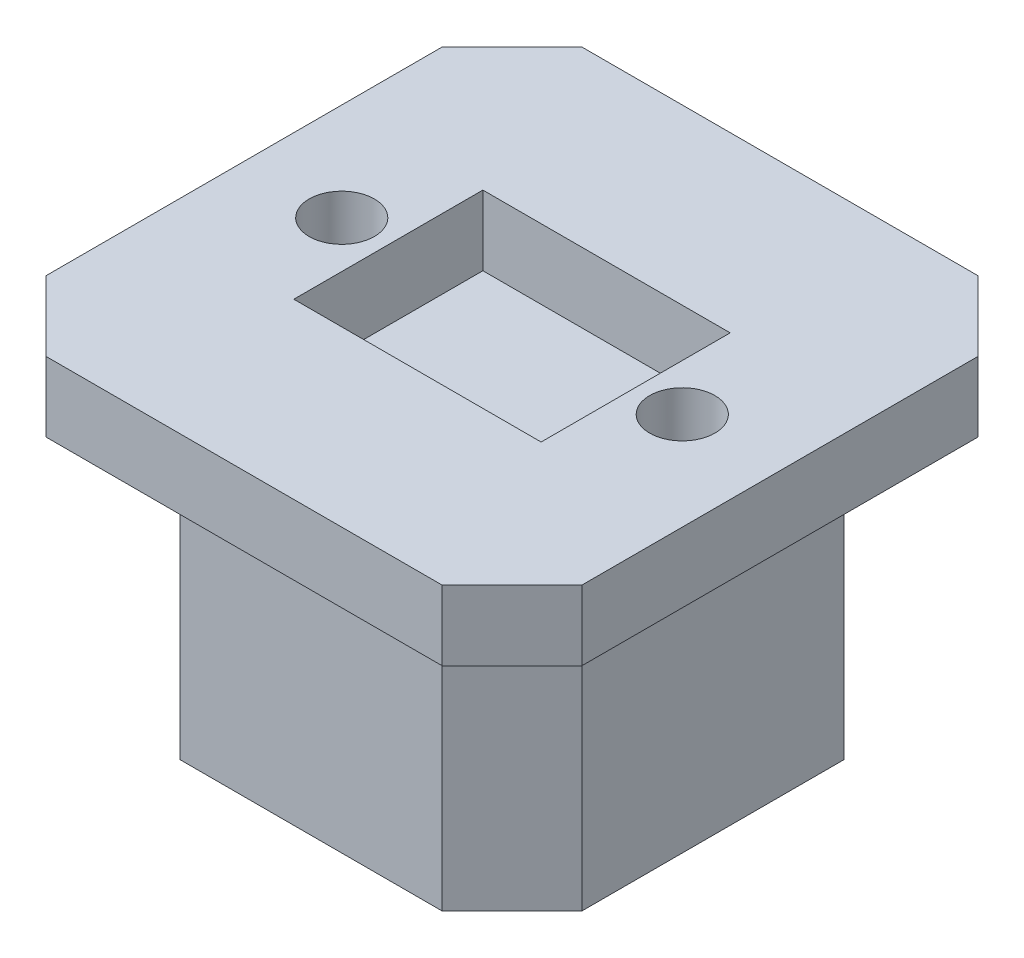
ISO-10303-21;
HEADER;
FILE_DESCRIPTION(('STEP AP214'),'2;1');
FILE_NAME('part.step','',(''),(''),'','','');
FILE_SCHEMA(('AUTOMOTIVE_DESIGN { 1 0 10303 214 1 1 1 1 }'));
ENDSEC;
DATA;
#1=APPLICATION_CONTEXT('core data for automotive mechanical design processes');
#2=APPLICATION_PROTOCOL_DEFINITION('international standard','automotive_design',2000,#1);
#3=PRODUCT_CONTEXT('',#1,'mechanical');
#4=PRODUCT('Part','Part','',(#3));
#5=PRODUCT_RELATED_PRODUCT_CATEGORY('part','',(#4));
#6=PRODUCT_DEFINITION_FORMATION('','',#4);
#7=PRODUCT_DEFINITION_CONTEXT('part definition',#1,'design');
#8=PRODUCT_DEFINITION('design','',#6,#7);
#9=PRODUCT_DEFINITION_SHAPE('','',#8);
#10=(LENGTH_UNIT() NAMED_UNIT(*) SI_UNIT(.MILLI.,.METRE.));
#11=(NAMED_UNIT(*) PLANE_ANGLE_UNIT() SI_UNIT($,.RADIAN.));
#12=(NAMED_UNIT(*) SI_UNIT($,.STERADIAN.) SOLID_ANGLE_UNIT());
#13=UNCERTAINTY_MEASURE_WITH_UNIT(LENGTH_MEASURE(1.E-05),#10,'distance_accuracy_value','');
#14=(GEOMETRIC_REPRESENTATION_CONTEXT(3) GLOBAL_UNCERTAINTY_ASSIGNED_CONTEXT((#13)) GLOBAL_UNIT_ASSIGNED_CONTEXT((#10,
#11,#12)) REPRESENTATION_CONTEXT('',''));
#15=CARTESIAN_POINT('',(0.,0.,0.));
#16=DIRECTION('',(0.,0.,1.));
#17=DIRECTION('',(1.,0.,0.));
#18=AXIS2_PLACEMENT_3D('',#15,#16,#17);
#19=CARTESIAN_POINT('',(19.1751156121995,5.,19.1751156121995));
#20=DIRECTION('',(-1.,0.,0.));
#21=DIRECTION('',(0.,0.,1.));
#22=AXIS2_PLACEMENT_3D('',#19,#20,#21);
#23=PLANE('',#22);
#24=DIRECTION('',(0.,0.,-1.));
#25=VECTOR('',#24,1.);
#26=CARTESIAN_POINT('',(19.1751156121995,5.,19.1751156121995));
#27=LINE('',#26,#25);
#28=CARTESIAN_POINT('',(19.1751156121995,5.,14.1751156121995));
#29=VERTEX_POINT('',#28);
#30=CARTESIAN_POINT('',(19.1751156121995,5.,-14.1751156121995));
#31=VERTEX_POINT('',#30);
#32=EDGE_CURVE('E224',#29,#31,#27,.T.);
#33=ORIENTED_EDGE('',*,*,#32,.F.);
#34=DIRECTION('',(0.,-1.,0.));
#35=VECTOR('',#34,1.);
#36=CARTESIAN_POINT('',(19.1751156121995,5.,14.1751156121995));
#37=LINE('',#36,#35);
#38=CARTESIAN_POINT('',(19.1751156121995,0.,14.1751156121995));
#39=VERTEX_POINT('',#38);
#40=EDGE_CURVE('E277',#29,#39,#37,.T.);
#41=ORIENTED_EDGE('',*,*,#40,.T.);
#42=DIRECTION('',(0.,0.,-1.));
#43=VECTOR('',#42,1.);
#44=CARTESIAN_POINT('',(19.1751156121995,0.,19.1751156121995));
#45=LINE('',#44,#43);
#46=CARTESIAN_POINT('',(19.1751156121995,0.,-14.1751156121995));
#47=VERTEX_POINT('',#46);
#48=EDGE_CURVE('E238',#39,#47,#45,.T.);
#49=ORIENTED_EDGE('',*,*,#48,.T.);
#50=DIRECTION('',(0.,1.,0.));
#51=VECTOR('',#50,1.);
#52=CARTESIAN_POINT('',(19.1751156121995,5.,-14.1751156121995));
#53=LINE('',#52,#51);
#54=EDGE_CURVE('E275',#47,#31,#53,.T.);
#55=ORIENTED_EDGE('',*,*,#54,.T.);
#56=EDGE_LOOP('',(#33,#41,#49,#55));
#57=FACE_BOUND('',#56,.T.);
#58=ADVANCED_FACE('F34',(#57),#23,.F.);
#59=CARTESIAN_POINT('',(-19.1751156121995,5.,-19.1751156121995));
#60=DIRECTION('',(0.,0.,1.));
#61=DIRECTION('',(1.,0.,0.));
#62=AXIS2_PLACEMENT_3D('',#59,#60,#61);
#63=PLANE('',#62);
#64=DIRECTION('',(-1.,0.,0.));
#65=VECTOR('',#64,1.);
#66=CARTESIAN_POINT('',(-19.1751156121995,5.,-19.1751156121995));
#67=LINE('',#66,#65);
#68=CARTESIAN_POINT('',(14.1751156121995,5.,-19.1751156121995));
#69=VERTEX_POINT('',#68);
#70=CARTESIAN_POINT('',(-14.1751156121995,5.,-19.1751156121995));
#71=VERTEX_POINT('',#70);
#72=EDGE_CURVE('E227',#69,#71,#67,.T.);
#73=ORIENTED_EDGE('',*,*,#72,.F.);
#74=DIRECTION('',(0.,-1.,0.));
#75=VECTOR('',#74,1.);
#76=CARTESIAN_POINT('',(14.1751156121995,5.,-19.1751156121995));
#77=LINE('',#76,#75);
#78=CARTESIAN_POINT('',(14.1751156121995,0.,-19.1751156121995));
#79=VERTEX_POINT('',#78);
#80=EDGE_CURVE('E303',#69,#79,#77,.T.);
#81=ORIENTED_EDGE('',*,*,#80,.T.);
#82=DIRECTION('',(-1.,0.,0.));
#83=VECTOR('',#82,1.);
#84=CARTESIAN_POINT('',(-19.1751156121995,0.,-19.1751156121995));
#85=LINE('',#84,#83);
#86=CARTESIAN_POINT('',(-14.1751156121995,0.,-19.1751156121995));
#87=VERTEX_POINT('',#86);
#88=EDGE_CURVE('E241',#79,#87,#85,.T.);
#89=ORIENTED_EDGE('',*,*,#88,.T.);
#90=DIRECTION('',(0.,1.,0.));
#91=VECTOR('',#90,1.);
#92=CARTESIAN_POINT('',(-14.1751156121995,5.,-19.1751156121995));
#93=LINE('',#92,#91);
#94=EDGE_CURVE('E301',#87,#71,#93,.T.);
#95=ORIENTED_EDGE('',*,*,#94,.T.);
#96=EDGE_LOOP('',(#73,#81,#89,#95));
#97=FACE_BOUND('',#96,.T.);
#98=ADVANCED_FACE('F426',(#97),#63,.F.);
#99=CARTESIAN_POINT('',(-19.1751156121995,5.,19.1751156121995));
#100=DIRECTION('',(1.,0.,0.));
#101=DIRECTION('',(0.,0.,-1.));
#102=AXIS2_PLACEMENT_3D('',#99,#100,#101);
#103=PLANE('',#102);
#104=DIRECTION('',(0.,0.,1.));
#105=VECTOR('',#104,1.);
#106=CARTESIAN_POINT('',(-19.1751156121995,5.,19.1751156121995));
#107=LINE('',#106,#105);
#108=CARTESIAN_POINT('',(-19.1751156121995,5.,-14.1751156121995));
#109=VERTEX_POINT('',#108);
#110=CARTESIAN_POINT('',(-19.1751156121995,5.,14.1751156121995));
#111=VERTEX_POINT('',#110);
#112=EDGE_CURVE('E231',#109,#111,#107,.T.);
#113=ORIENTED_EDGE('',*,*,#112,.F.);
#114=DIRECTION('',(0.,-1.,0.));
#115=VECTOR('',#114,1.);
#116=CARTESIAN_POINT('',(-19.1751156121995,5.,-14.1751156121995));
#117=LINE('',#116,#115);
#118=CARTESIAN_POINT('',(-19.1751156121995,0.,-14.1751156121995));
#119=VERTEX_POINT('',#118);
#120=EDGE_CURVE('E308',#109,#119,#117,.T.);
#121=ORIENTED_EDGE('',*,*,#120,.T.);
#122=DIRECTION('',(0.,0.,1.));
#123=VECTOR('',#122,1.);
#124=CARTESIAN_POINT('',(-19.1751156121995,0.,19.1751156121995));
#125=LINE('',#124,#123);
#126=CARTESIAN_POINT('',(-19.1751156121995,0.,14.1751156121995));
#127=VERTEX_POINT('',#126);
#128=EDGE_CURVE('E245',#119,#127,#125,.T.);
#129=ORIENTED_EDGE('',*,*,#128,.T.);
#130=DIRECTION('',(0.,1.,0.));
#131=VECTOR('',#130,1.);
#132=CARTESIAN_POINT('',(-19.1751156121995,5.,14.1751156121995));
#133=LINE('',#132,#131);
#134=EDGE_CURVE('E306',#127,#111,#133,.T.);
#135=ORIENTED_EDGE('',*,*,#134,.T.);
#136=EDGE_LOOP('',(#113,#121,#129,#135));
#137=FACE_BOUND('',#136,.T.);
#138=ADVANCED_FACE('F432',(#137),#103,.F.);
#139=CARTESIAN_POINT('',(-19.1751156121995,5.,19.1751156121995));
#140=DIRECTION('',(0.,0.,-1.));
#141=DIRECTION('',(-1.,0.,0.));
#142=AXIS2_PLACEMENT_3D('',#139,#140,#141);
#143=PLANE('',#142);
#144=DIRECTION('',(1.,0.,0.));
#145=VECTOR('',#144,1.);
#146=CARTESIAN_POINT('',(-19.1751156121995,0.,19.1751156121995));
#147=LINE('',#146,#145);
#148=CARTESIAN_POINT('',(-14.1751156121995,0.,19.1751156121995));
#149=VERTEX_POINT('',#148);
#150=CARTESIAN_POINT('',(14.1751156121995,0.,19.1751156121995));
#151=VERTEX_POINT('',#150);
#152=EDGE_CURVE('E228',#149,#151,#147,.T.);
#153=ORIENTED_EDGE('',*,*,#152,.T.);
#154=DIRECTION('',(0.,1.,0.));
#155=VECTOR('',#154,1.);
#156=CARTESIAN_POINT('',(14.1751156121995,5.,19.1751156121995));
#157=LINE('',#156,#155);
#158=CARTESIAN_POINT('',(14.1751156121995,5.,19.1751156121995));
#159=VERTEX_POINT('',#158);
#160=EDGE_CURVE('E291',#151,#159,#157,.T.);
#161=ORIENTED_EDGE('',*,*,#160,.T.);
#162=DIRECTION('',(1.,0.,0.));
#163=VECTOR('',#162,1.);
#164=CARTESIAN_POINT('',(-19.1751156121995,5.,19.1751156121995));
#165=LINE('',#164,#163);
#166=CARTESIAN_POINT('',(-14.1751156121995,5.,19.1751156121995));
#167=VERTEX_POINT('',#166);
#168=EDGE_CURVE('E234',#167,#159,#165,.T.);
#169=ORIENTED_EDGE('',*,*,#168,.F.);
#170=DIRECTION('',(0.,-1.,0.));
#171=VECTOR('',#170,1.);
#172=CARTESIAN_POINT('',(-14.1751156121995,5.,19.1751156121995));
#173=LINE('',#172,#171);
#174=EDGE_CURVE('E288',#167,#149,#173,.T.);
#175=ORIENTED_EDGE('',*,*,#174,.T.);
#176=EDGE_LOOP('',(#153,#161,#169,#175));
#177=FACE_BOUND('',#176,.T.);
#178=ADVANCED_FACE('F470',(#177),#143,.F.);
#179=CARTESIAN_POINT('',(0.,5.,0.));
#180=DIRECTION('',(0.,-1.,0.));
#181=DIRECTION('',(0.,0.,-1.));
#182=AXIS2_PLACEMENT_3D('',#179,#180,#181);
#183=PLANE('',#182);
#184=CARTESIAN_POINT('',(12.184831311045,5.,0.));
#185=DIRECTION('',(0.,1.,0.));
#186=DIRECTION('',(0.,0.,-1.));
#187=AXIS2_PLACEMENT_3D('',#184,#185,#186);
#188=CIRCLE('',#187,2.33271488157216);
#189=CARTESIAN_POINT('',(12.184831311045,5.,-2.33271488157216));
#190=VERTEX_POINT('',#189);
#191=EDGE_CURVE('E194',#190,#190,#188,.T.);
#192=ORIENTED_EDGE('',*,*,#191,.F.);
#193=EDGE_LOOP('',(#192));
#194=FACE_BOUND('',#193,.T.);
#195=CARTESIAN_POINT('',(-12.184831311045,5.,0.));
#196=DIRECTION('',(0.,1.,0.));
#197=DIRECTION('',(0.,0.,1.));
#198=AXIS2_PLACEMENT_3D('',#195,#196,#197);
#199=CIRCLE('',#198,2.33271488157216);
#200=CARTESIAN_POINT('',(-12.184831311045,5.,2.33271488157216));
#201=VERTEX_POINT('',#200);
#202=EDGE_CURVE('E200',#201,#201,#199,.T.);
#203=ORIENTED_EDGE('',*,*,#202,.F.);
#204=EDGE_LOOP('',(#203));
#205=FACE_BOUND('',#204,.T.);
#206=DIRECTION('',(0.,0.,-1.));
#207=VECTOR('',#206,1.);
#208=CARTESIAN_POINT('',(8.84957474512028,5.,-6.76565903755647));
#209=LINE('',#208,#207);
#210=CARTESIAN_POINT('',(8.84957474512028,5.,6.76565903755647));
#211=VERTEX_POINT('',#210);
#212=CARTESIAN_POINT('',(8.84957474512028,5.,-6.76565903755647));
#213=VERTEX_POINT('',#212);
#214=EDGE_CURVE('E371',#211,#213,#209,.T.);
#215=ORIENTED_EDGE('',*,*,#214,.F.);
#216=DIRECTION('',(1.,0.,0.));
#217=VECTOR('',#216,1.);
#218=CARTESIAN_POINT('',(8.84957474512028,5.,6.76565903755647));
#219=LINE('',#218,#217);
#220=CARTESIAN_POINT('',(-8.84957474512028,5.,6.76565903755647));
#221=VERTEX_POINT('',#220);
#222=EDGE_CURVE('E374',#221,#211,#219,.T.);
#223=ORIENTED_EDGE('',*,*,#222,.F.);
#224=DIRECTION('',(0.,0.,1.));
#225=VECTOR('',#224,1.);
#226=CARTESIAN_POINT('',(-8.84957474512028,5.,-6.76565903755647));
#227=LINE('',#226,#225);
#228=CARTESIAN_POINT('',(-8.84957474512028,5.,-6.76565903755647));
#229=VERTEX_POINT('',#228);
#230=EDGE_CURVE('E359',#229,#221,#227,.T.);
#231=ORIENTED_EDGE('',*,*,#230,.F.);
#232=DIRECTION('',(-1.,0.,0.));
#233=VECTOR('',#232,1.);
#234=CARTESIAN_POINT('',(8.84957474512028,5.,-6.76565903755647));
#235=LINE('',#234,#233);
#236=EDGE_CURVE('E368',#213,#229,#235,.T.);
#237=ORIENTED_EDGE('',*,*,#236,.F.);
#238=EDGE_LOOP('',(#215,#223,#231,#237));
#239=FACE_BOUND('',#238,.T.);
#240=ORIENTED_EDGE('',*,*,#168,.T.);
#241=DIRECTION('',(-0.707106781186549,0.,0.707106781186547));
#242=VECTOR('',#241,1.);
#243=CARTESIAN_POINT('',(19.1751156121995,5.,14.1751156121995));
#244=LINE('',#243,#242);
#245=EDGE_CURVE('E299',#159,#29,#244,.F.);
#246=ORIENTED_EDGE('',*,*,#245,.T.);
#247=ORIENTED_EDGE('',*,*,#32,.T.);
#248=DIRECTION('',(0.707106781186547,0.,0.707106781186549));
#249=VECTOR('',#248,1.);
#250=CARTESIAN_POINT('',(14.1751156121995,5.,-19.1751156121995));
#251=LINE('',#250,#249);
#252=EDGE_CURVE('E297',#31,#69,#251,.F.);
#253=ORIENTED_EDGE('',*,*,#252,.T.);
#254=ORIENTED_EDGE('',*,*,#72,.T.);
#255=DIRECTION('',(0.707106781186549,0.,-0.707106781186547));
#256=VECTOR('',#255,1.);
#257=CARTESIAN_POINT('',(-19.1751156121995,5.,-14.1751156121995));
#258=LINE('',#257,#256);
#259=EDGE_CURVE('E295',#71,#109,#258,.F.);
#260=ORIENTED_EDGE('',*,*,#259,.T.);
#261=ORIENTED_EDGE('',*,*,#112,.T.);
#262=DIRECTION('',(-0.707106781186547,0.,-0.707106781186549));
#263=VECTOR('',#262,1.);
#264=CARTESIAN_POINT('',(-14.1751156121995,5.,19.1751156121995));
#265=LINE('',#264,#263);
#266=EDGE_CURVE('E293',#111,#167,#265,.F.);
#267=ORIENTED_EDGE('',*,*,#266,.T.);
#268=EDGE_LOOP('',(#240,#246,#247,#253,#254,#260,#261,#267));
#269=FACE_BOUND('',#268,.T.);
#270=ADVANCED_FACE('F406',(#194,#205,#239,#269),#183,.F.);
#271=CARTESIAN_POINT('',(0.,0.,0.));
#272=DIRECTION('',(0.,-1.,0.));
#273=DIRECTION('',(0.,0.,-1.));
#274=AXIS2_PLACEMENT_3D('',#271,#272,#273);
#275=PLANE('',#274);
#276=CARTESIAN_POINT('',(12.184831311045,0.,0.));
#277=DIRECTION('',(0.,-1.,0.));
#278=DIRECTION('',(0.,0.,-1.));
#279=AXIS2_PLACEMENT_3D('',#276,#277,#278);
#280=CIRCLE('',#279,2.33271488157216);
#281=CARTESIAN_POINT('',(14.3751156121995,0.,0.802629054310911));
#282=VERTEX_POINT('',#281);
#283=CARTESIAN_POINT('',(14.3751156121995,0.,-0.802629054310903));
#284=VERTEX_POINT('',#283);
#285=EDGE_CURVE('E48',#282,#284,#280,.F.);
#286=ORIENTED_EDGE('',*,*,#285,.T.);
#287=DIRECTION('',(0.,0.,-1.));
#288=VECTOR('',#287,1.);
#289=CARTESIAN_POINT('',(14.3751156121995,0.,14.3751156121995));
#290=LINE('',#289,#288);
#291=CARTESIAN_POINT('',(14.3751156121995,0.,-9.37511561219954));
#292=VERTEX_POINT('',#291);
#293=EDGE_CURVE('E191',#284,#292,#290,.T.);
#294=ORIENTED_EDGE('',*,*,#293,.T.);
#295=DIRECTION('',(0.707106781186549,0.,0.707106781186547));
#296=VECTOR('',#295,1.);
#297=CARTESIAN_POINT('',(14.3751156121995,0.,-9.37511561219954));
#298=LINE('',#297,#296);
#299=CARTESIAN_POINT('',(9.37511561219952,0.,-14.3751156121995));
#300=VERTEX_POINT('',#299);
#301=EDGE_CURVE('E42',#292,#300,#298,.F.);
#302=ORIENTED_EDGE('',*,*,#301,.T.);
#303=DIRECTION('',(-1.,0.,0.));
#304=VECTOR('',#303,1.);
#305=CARTESIAN_POINT('',(-14.3751156121995,0.,-14.3751156121995));
#306=LINE('',#305,#304);
#307=CARTESIAN_POINT('',(-9.37511561219954,0.,-14.3751156121995));
#308=VERTEX_POINT('',#307);
#309=EDGE_CURVE('E211',#300,#308,#306,.T.);
#310=ORIENTED_EDGE('',*,*,#309,.T.);
#311=DIRECTION('',(0.707106781186547,0.,-0.707106781186549));
#312=VECTOR('',#311,1.);
#313=CARTESIAN_POINT('',(-9.37511561219954,0.,-14.3751156121995));
#314=LINE('',#313,#312);
#315=CARTESIAN_POINT('',(-14.3751156121995,0.,-9.37511561219952));
#316=VERTEX_POINT('',#315);
#317=EDGE_CURVE('E313',#308,#316,#314,.F.);
#318=ORIENTED_EDGE('',*,*,#317,.T.);
#319=DIRECTION('',(0.,0.,1.));
#320=VECTOR('',#319,1.);
#321=CARTESIAN_POINT('',(-14.3751156121995,0.,14.3751156121995));
#322=LINE('',#321,#320);
#323=CARTESIAN_POINT('',(-14.3751156121995,0.,-0.802629054310904));
#324=VERTEX_POINT('',#323);
#325=EDGE_CURVE('E217',#316,#324,#322,.T.);
#326=ORIENTED_EDGE('',*,*,#325,.T.);
#327=CARTESIAN_POINT('',(-12.184831311045,0.,0.));
#328=DIRECTION('',(0.,-1.,0.));
#329=DIRECTION('',(0.,0.,-1.));
#330=AXIS2_PLACEMENT_3D('',#327,#328,#329);
#331=CIRCLE('',#330,2.33271488157216);
#332=CARTESIAN_POINT('',(-14.3751156121995,0.,0.802629054310911));
#333=VERTEX_POINT('',#332);
#334=EDGE_CURVE('E55',#324,#333,#331,.F.);
#335=ORIENTED_EDGE('',*,*,#334,.T.);
#336=CARTESIAN_POINT('',(-14.3751156121995,0.,9.37511561219954));
#337=VERTEX_POINT('',#336);
#338=EDGE_CURVE('E213',#333,#337,#322,.T.);
#339=ORIENTED_EDGE('',*,*,#338,.T.);
#340=DIRECTION('',(-0.707106781186549,0.,-0.707106781186547));
#341=VECTOR('',#340,1.);
#342=CARTESIAN_POINT('',(-14.3751156121995,0.,9.37511561219954));
#343=LINE('',#342,#341);
#344=CARTESIAN_POINT('',(-9.37511561219952,0.,14.3751156121995));
#345=VERTEX_POINT('',#344);
#346=EDGE_CURVE('E311',#337,#345,#343,.F.);
#347=ORIENTED_EDGE('',*,*,#346,.T.);
#348=DIRECTION('',(1.,0.,0.));
#349=VECTOR('',#348,1.);
#350=CARTESIAN_POINT('',(-14.3751156121995,0.,14.3751156121995));
#351=LINE('',#350,#349);
#352=CARTESIAN_POINT('',(9.37511561219954,0.,14.3751156121995));
#353=VERTEX_POINT('',#352);
#354=EDGE_CURVE('E220',#345,#353,#351,.T.);
#355=ORIENTED_EDGE('',*,*,#354,.T.);
#356=DIRECTION('',(-0.707106781186547,0.,0.707106781186549));
#357=VECTOR('',#356,1.);
#358=CARTESIAN_POINT('',(9.37511561219954,0.,14.3751156121995));
#359=LINE('',#358,#357);
#360=CARTESIAN_POINT('',(14.3751156121995,0.,9.37511561219952));
#361=VERTEX_POINT('',#360);
#362=EDGE_CURVE('E11',#353,#361,#359,.F.);
#363=ORIENTED_EDGE('',*,*,#362,.T.);
#364=EDGE_CURVE('E190',#361,#282,#290,.T.);
#365=ORIENTED_EDGE('',*,*,#364,.T.);
#366=EDGE_LOOP('',(#286,#294,#302,#310,#318,#326,#335,#339,#347,#355,#363,#365));
#367=FACE_BOUND('',#366,.T.);
#368=ORIENTED_EDGE('',*,*,#48,.F.);
#369=DIRECTION('',(0.707106781186549,0.,-0.707106781186547));
#370=VECTOR('',#369,1.);
#371=CARTESIAN_POINT('',(16.6751156121995,0.,16.6751156121996));
#372=LINE('',#371,#370);
#373=EDGE_CURVE('E286',#39,#151,#372,.F.);
#374=ORIENTED_EDGE('',*,*,#373,.T.);
#375=ORIENTED_EDGE('',*,*,#152,.F.);
#376=DIRECTION('',(0.707106781186547,0.,0.707106781186549));
#377=VECTOR('',#376,1.);
#378=CARTESIAN_POINT('',(-16.6751156121996,0.,16.6751156121995));
#379=LINE('',#378,#377);
#380=EDGE_CURVE('E280',#149,#127,#379,.F.);
#381=ORIENTED_EDGE('',*,*,#380,.T.);
#382=ORIENTED_EDGE('',*,*,#128,.F.);
#383=DIRECTION('',(-0.707106781186549,0.,0.707106781186547));
#384=VECTOR('',#383,1.);
#385=CARTESIAN_POINT('',(-16.6751156121995,0.,-16.6751156121996));
#386=LINE('',#385,#384);
#387=EDGE_CURVE('E282',#119,#87,#386,.F.);
#388=ORIENTED_EDGE('',*,*,#387,.T.);
#389=ORIENTED_EDGE('',*,*,#88,.F.);
#390=DIRECTION('',(-0.707106781186547,0.,-0.707106781186549));
#391=VECTOR('',#390,1.);
#392=CARTESIAN_POINT('',(16.6751156121996,0.,-16.6751156121995));
#393=LINE('',#392,#391);
#394=EDGE_CURVE('E284',#79,#47,#393,.F.);
#395=ORIENTED_EDGE('',*,*,#394,.T.);
#396=EDGE_LOOP('',(#368,#374,#375,#381,#382,#388,#389,#395));
#397=FACE_BOUND('',#396,.T.);
#398=ADVANCED_FACE('F197',(#367,#397),#275,.T.);
#399=CARTESIAN_POINT('',(14.3751156121995,-20.,14.3751156121995));
#400=DIRECTION('',(1.,0.,0.));
#401=DIRECTION('',(0.,0.,-1.));
#402=AXIS2_PLACEMENT_3D('',#399,#400,#401);
#403=PLANE('',#402);
#404=DIRECTION('',(0.,0.,-1.));
#405=VECTOR('',#404,1.);
#406=CARTESIAN_POINT('',(14.3751156121995,-20.,14.3751156121995));
#407=LINE('',#406,#405);
#408=CARTESIAN_POINT('',(14.3751156121995,-20.,9.37511561219952));
#409=VERTEX_POINT('',#408);
#410=CARTESIAN_POINT('',(14.3751156121995,-20.,-9.37511561219953));
#411=VERTEX_POINT('',#410);
#412=EDGE_CURVE('E223',#409,#411,#407,.T.);
#413=ORIENTED_EDGE('',*,*,#412,.T.);
#414=DIRECTION('',(0.,1.,0.));
#415=VECTOR('',#414,1.);
#416=CARTESIAN_POINT('',(14.3751156121995,-20.,-9.37511561219954));
#417=LINE('',#416,#415);
#418=EDGE_CURVE('E205',#411,#292,#417,.T.);
#419=ORIENTED_EDGE('',*,*,#418,.T.);
#420=ORIENTED_EDGE('',*,*,#293,.F.);
#421=EDGE_CURVE('E183',#282,#284,#290,.T.);
#422=ORIENTED_EDGE('',*,*,#421,.F.);
#423=ORIENTED_EDGE('',*,*,#364,.F.);
#424=DIRECTION('',(0.,-1.,0.));
#425=VECTOR('',#424,1.);
#426=CARTESIAN_POINT('',(14.3751156121995,-20.,9.37511561219952));
#427=LINE('',#426,#425);
#428=EDGE_CURVE('E272',#361,#409,#427,.T.);
#429=ORIENTED_EDGE('',*,*,#428,.T.);
#430=EDGE_LOOP('',(#413,#419,#420,#422,#423,#429));
#431=FACE_BOUND('',#430,.T.);
#432=ADVANCED_FACE('F203',(#431),#403,.T.);
#433=CARTESIAN_POINT('',(-14.3751156121995,-20.,14.3751156121995));
#434=DIRECTION('',(0.,0.,1.));
#435=DIRECTION('',(1.,0.,0.));
#436=AXIS2_PLACEMENT_3D('',#433,#434,#435);
#437=PLANE('',#436);
#438=ORIENTED_EDGE('',*,*,#354,.F.);
#439=DIRECTION('',(0.,-1.,0.));
#440=VECTOR('',#439,1.);
#441=CARTESIAN_POINT('',(-9.37511561219952,-20.,14.3751156121995));
#442=LINE('',#441,#440);
#443=CARTESIAN_POINT('',(-9.37511561219952,-20.,14.3751156121995));
#444=VERTEX_POINT('',#443);
#445=EDGE_CURVE('E257',#345,#444,#442,.T.);
#446=ORIENTED_EDGE('',*,*,#445,.T.);
#447=DIRECTION('',(1.,0.,0.));
#448=VECTOR('',#447,1.);
#449=CARTESIAN_POINT('',(-14.3751156121995,-20.,14.3751156121995));
#450=LINE('',#449,#448);
#451=CARTESIAN_POINT('',(9.37511561219953,-20.,14.3751156121995));
#452=VERTEX_POINT('',#451);
#453=EDGE_CURVE('E242',#444,#452,#450,.T.);
#454=ORIENTED_EDGE('',*,*,#453,.T.);
#455=DIRECTION('',(0.,1.,0.));
#456=VECTOR('',#455,1.);
#457=CARTESIAN_POINT('',(9.37511561219954,-20.,14.3751156121995));
#458=LINE('',#457,#456);
#459=EDGE_CURVE('E254',#452,#353,#458,.T.);
#460=ORIENTED_EDGE('',*,*,#459,.T.);
#461=EDGE_LOOP('',(#438,#446,#454,#460));
#462=FACE_BOUND('',#461,.T.);
#463=ADVANCED_FACE('F340',(#462),#437,.T.);
#464=CARTESIAN_POINT('',(-14.3751156121995,-20.,14.3751156121995));
#465=DIRECTION('',(-1.,0.,0.));
#466=DIRECTION('',(0.,0.,1.));
#467=AXIS2_PLACEMENT_3D('',#464,#465,#466);
#468=PLANE('',#467);
#469=DIRECTION('',(0.,0.,1.));
#470=VECTOR('',#469,1.);
#471=CARTESIAN_POINT('',(-14.3751156121995,-20.,14.3751156121995));
#472=LINE('',#471,#470);
#473=CARTESIAN_POINT('',(-14.3751156121995,-20.,-9.37511561219952));
#474=VERTEX_POINT('',#473);
#475=CARTESIAN_POINT('',(-14.3751156121995,-20.,9.37511561219954));
#476=VERTEX_POINT('',#475);
#477=EDGE_CURVE('E331',#474,#476,#472,.T.);
#478=ORIENTED_EDGE('',*,*,#477,.T.);
#479=DIRECTION('',(0.,1.,0.));
#480=VECTOR('',#479,1.);
#481=CARTESIAN_POINT('',(-14.3751156121995,-20.,9.37511561219954));
#482=LINE('',#481,#480);
#483=EDGE_CURVE('E251',#476,#337,#482,.T.);
#484=ORIENTED_EDGE('',*,*,#483,.T.);
#485=ORIENTED_EDGE('',*,*,#338,.F.);
#486=EDGE_CURVE('E215',#324,#333,#322,.T.);
#487=ORIENTED_EDGE('',*,*,#486,.F.);
#488=ORIENTED_EDGE('',*,*,#325,.F.);
#489=DIRECTION('',(0.,-1.,0.));
#490=VECTOR('',#489,1.);
#491=CARTESIAN_POINT('',(-14.3751156121995,-20.,-9.37511561219952));
#492=LINE('',#491,#490);
#493=EDGE_CURVE('E237',#316,#474,#492,.T.);
#494=ORIENTED_EDGE('',*,*,#493,.T.);
#495=EDGE_LOOP('',(#478,#484,#485,#487,#488,#494));
#496=FACE_BOUND('',#495,.T.);
#497=ADVANCED_FACE('F352',(#496),#468,.T.);
#498=CARTESIAN_POINT('',(-14.3751156121995,-20.,-14.3751156121995));
#499=DIRECTION('',(0.,0.,-1.));
#500=DIRECTION('',(-1.,0.,0.));
#501=AXIS2_PLACEMENT_3D('',#498,#499,#500);
#502=PLANE('',#501);
#503=DIRECTION('',(-1.,0.,0.));
#504=VECTOR('',#503,1.);
#505=CARTESIAN_POINT('',(-14.3751156121995,-20.,-14.3751156121995));
#506=LINE('',#505,#504);
#507=CARTESIAN_POINT('',(9.37511561219952,-20.,-14.3751156121995));
#508=VERTEX_POINT('',#507);
#509=CARTESIAN_POINT('',(-9.37511561219954,-20.,-14.3751156121995));
#510=VERTEX_POINT('',#509);
#511=EDGE_CURVE('E328',#508,#510,#506,.T.);
#512=ORIENTED_EDGE('',*,*,#511,.T.);
#513=DIRECTION('',(0.,1.,0.));
#514=VECTOR('',#513,1.);
#515=CARTESIAN_POINT('',(-9.37511561219954,-20.,-14.3751156121995));
#516=LINE('',#515,#514);
#517=EDGE_CURVE('E269',#510,#308,#516,.T.);
#518=ORIENTED_EDGE('',*,*,#517,.T.);
#519=ORIENTED_EDGE('',*,*,#309,.F.);
#520=DIRECTION('',(0.,-1.,0.));
#521=VECTOR('',#520,1.);
#522=CARTESIAN_POINT('',(9.37511561219952,-20.,-14.3751156121995));
#523=LINE('',#522,#521);
#524=EDGE_CURVE('E267',#300,#508,#523,.T.);
#525=ORIENTED_EDGE('',*,*,#524,.T.);
#526=EDGE_LOOP('',(#512,#518,#519,#525));
#527=FACE_BOUND('',#526,.T.);
#528=ADVANCED_FACE('F318',(#527),#502,.T.);
#529=CARTESIAN_POINT('',(0.,-20.,0.));
#530=DIRECTION('',(0.,-1.,0.));
#531=DIRECTION('',(0.,0.,-1.));
#532=AXIS2_PLACEMENT_3D('',#529,#530,#531);
#533=PLANE('',#532);
#534=CARTESIAN_POINT('',(0.,-20.,0.));
#535=DIRECTION('',(0.,-1.,0.));
#536=DIRECTION('',(0.,0.,-1.));
#537=AXIS2_PLACEMENT_3D('',#534,#535,#536);
#538=CIRCLE('',#537,4.31921365270648);
#539=CARTESIAN_POINT('',(0.,-20.,-4.31921365270648));
#540=VERTEX_POINT('',#539);
#541=EDGE_CURVE('E633',#540,#540,#538,.T.);
#542=ORIENTED_EDGE('',*,*,#541,.F.);
#543=EDGE_LOOP('',(#542));
#544=FACE_BOUND('',#543,.T.);
#545=ORIENTED_EDGE('',*,*,#453,.F.);
#546=DIRECTION('',(0.707106781186549,0.,0.707106781186547));
#547=VECTOR('',#546,1.);
#548=CARTESIAN_POINT('',(-11.8751156121995,-20.,11.8751156121996));
#549=LINE('',#548,#547);
#550=EDGE_CURVE('E265',#444,#476,#549,.F.);
#551=ORIENTED_EDGE('',*,*,#550,.T.);
#552=ORIENTED_EDGE('',*,*,#477,.F.);
#553=DIRECTION('',(-0.707106781186547,0.,0.707106781186549));
#554=VECTOR('',#553,1.);
#555=CARTESIAN_POINT('',(-11.8751156121996,-20.,-11.8751156121995));
#556=LINE('',#555,#554);
#557=EDGE_CURVE('E263',#474,#510,#556,.F.);
#558=ORIENTED_EDGE('',*,*,#557,.T.);
#559=ORIENTED_EDGE('',*,*,#511,.F.);
#560=DIRECTION('',(-0.707106781186549,0.,-0.707106781186547));
#561=VECTOR('',#560,1.);
#562=CARTESIAN_POINT('',(11.8751156121995,-20.,-11.8751156121996));
#563=LINE('',#562,#561);
#564=EDGE_CURVE('E261',#508,#411,#563,.F.);
#565=ORIENTED_EDGE('',*,*,#564,.T.);
#566=ORIENTED_EDGE('',*,*,#412,.F.);
#567=DIRECTION('',(0.707106781186547,0.,-0.707106781186549));
#568=VECTOR('',#567,1.);
#569=CARTESIAN_POINT('',(11.8751156121996,-20.,11.8751156121995));
#570=LINE('',#569,#568);
#571=EDGE_CURVE('E259',#409,#452,#570,.F.);
#572=ORIENTED_EDGE('',*,*,#571,.T.);
#573=EDGE_LOOP('',(#545,#551,#552,#558,#559,#565,#566,#572));
#574=FACE_BOUND('',#573,.T.);
#575=ADVANCED_FACE('F326',(#544,#574),#533,.T.);
#576=CARTESIAN_POINT('',(-14.3751156121995,-20.,9.37511561219954));
#577=DIRECTION('',(0.707106781186546,0.,-0.707106781186548));
#578=DIRECTION('',(0.,1.,0.));
#579=AXIS2_PLACEMENT_3D('',#576,#577,#578);
#580=PLANE('',#579);
#581=ORIENTED_EDGE('',*,*,#550,.F.);
#582=ORIENTED_EDGE('',*,*,#445,.F.);
#583=ORIENTED_EDGE('',*,*,#346,.F.);
#584=ORIENTED_EDGE('',*,*,#483,.F.);
#585=EDGE_LOOP('',(#581,#582,#583,#584));
#586=FACE_BOUND('',#585,.T.);
#587=ADVANCED_FACE('F347',(#586),#580,.F.);
#588=CARTESIAN_POINT('',(-9.37511561219954,-20.,-14.3751156121995));
#589=DIRECTION('',(0.707106781186548,0.,0.707106781186546));
#590=DIRECTION('',(0.,1.,0.));
#591=AXIS2_PLACEMENT_3D('',#588,#589,#590);
#592=PLANE('',#591);
#593=ORIENTED_EDGE('',*,*,#557,.F.);
#594=ORIENTED_EDGE('',*,*,#493,.F.);
#595=ORIENTED_EDGE('',*,*,#317,.F.);
#596=ORIENTED_EDGE('',*,*,#517,.F.);
#597=EDGE_LOOP('',(#593,#594,#595,#596));
#598=FACE_BOUND('',#597,.T.);
#599=ADVANCED_FACE('F358',(#598),#592,.F.);
#600=CARTESIAN_POINT('',(14.3751156121995,-20.,-9.37511561219954));
#601=DIRECTION('',(-0.707106781186546,0.,0.707106781186548));
#602=DIRECTION('',(0.,1.,0.));
#603=AXIS2_PLACEMENT_3D('',#600,#601,#602);
#604=PLANE('',#603);
#605=ORIENTED_EDGE('',*,*,#564,.F.);
#606=ORIENTED_EDGE('',*,*,#524,.F.);
#607=ORIENTED_EDGE('',*,*,#301,.F.);
#608=ORIENTED_EDGE('',*,*,#418,.F.);
#609=EDGE_LOOP('',(#605,#606,#607,#608));
#610=FACE_BOUND('',#609,.T.);
#611=ADVANCED_FACE('F322',(#610),#604,.F.);
#612=CARTESIAN_POINT('',(9.37511561219954,-20.,14.3751156121995));
#613=DIRECTION('',(-0.707106781186548,0.,-0.707106781186546));
#614=DIRECTION('',(0.,1.,0.));
#615=AXIS2_PLACEMENT_3D('',#612,#613,#614);
#616=PLANE('',#615);
#617=ORIENTED_EDGE('',*,*,#571,.F.);
#618=ORIENTED_EDGE('',*,*,#428,.F.);
#619=ORIENTED_EDGE('',*,*,#362,.F.);
#620=ORIENTED_EDGE('',*,*,#459,.F.);
#621=EDGE_LOOP('',(#617,#618,#619,#620));
#622=FACE_BOUND('',#621,.T.);
#623=ADVANCED_FACE('F344',(#622),#616,.F.);
#624=CARTESIAN_POINT('',(19.1751156121995,5.,14.1751156121995));
#625=DIRECTION('',(-0.707106781186546,0.,-0.707106781186548));
#626=DIRECTION('',(0.,-1.,0.));
#627=AXIS2_PLACEMENT_3D('',#624,#625,#626);
#628=PLANE('',#627);
#629=ORIENTED_EDGE('',*,*,#245,.F.);
#630=ORIENTED_EDGE('',*,*,#160,.F.);
#631=ORIENTED_EDGE('',*,*,#373,.F.);
#632=ORIENTED_EDGE('',*,*,#40,.F.);
#633=EDGE_LOOP('',(#629,#630,#631,#632));
#634=FACE_BOUND('',#633,.T.);
#635=ADVANCED_FACE('F446',(#634),#628,.F.);
#636=CARTESIAN_POINT('',(14.1751156121995,5.,-19.1751156121995));
#637=DIRECTION('',(-0.707106781186548,0.,0.707106781186546));
#638=DIRECTION('',(0.,-1.,0.));
#639=AXIS2_PLACEMENT_3D('',#636,#637,#638);
#640=PLANE('',#639);
#641=ORIENTED_EDGE('',*,*,#252,.F.);
#642=ORIENTED_EDGE('',*,*,#54,.F.);
#643=ORIENTED_EDGE('',*,*,#394,.F.);
#644=ORIENTED_EDGE('',*,*,#80,.F.);
#645=EDGE_LOOP('',(#641,#642,#643,#644));
#646=FACE_BOUND('',#645,.T.);
#647=ADVANCED_FACE('F449',(#646),#640,.F.);
#648=CARTESIAN_POINT('',(-19.1751156121995,5.,-14.1751156121995));
#649=DIRECTION('',(0.707106781186546,0.,0.707106781186548));
#650=DIRECTION('',(0.,-1.,0.));
#651=AXIS2_PLACEMENT_3D('',#648,#649,#650);
#652=PLANE('',#651);
#653=ORIENTED_EDGE('',*,*,#259,.F.);
#654=ORIENTED_EDGE('',*,*,#94,.F.);
#655=ORIENTED_EDGE('',*,*,#387,.F.);
#656=ORIENTED_EDGE('',*,*,#120,.F.);
#657=EDGE_LOOP('',(#653,#654,#655,#656));
#658=FACE_BOUND('',#657,.T.);
#659=ADVANCED_FACE('F422',(#658),#652,.F.);
#660=CARTESIAN_POINT('',(-14.1751156121995,5.,19.1751156121995));
#661=DIRECTION('',(0.707106781186548,0.,-0.707106781186546));
#662=DIRECTION('',(0.,-1.,0.));
#663=AXIS2_PLACEMENT_3D('',#660,#661,#662);
#664=PLANE('',#663);
#665=ORIENTED_EDGE('',*,*,#266,.F.);
#666=ORIENTED_EDGE('',*,*,#134,.F.);
#667=ORIENTED_EDGE('',*,*,#380,.F.);
#668=ORIENTED_EDGE('',*,*,#174,.F.);
#669=EDGE_LOOP('',(#665,#666,#667,#668));
#670=FACE_BOUND('',#669,.T.);
#671=ADVANCED_FACE('F36',(#670),#664,.F.);
#672=CARTESIAN_POINT('',(0.,0.,0.));
#673=DIRECTION('',(0.,-1.,0.));
#674=DIRECTION('',(0.,0.,-1.));
#675=AXIS2_PLACEMENT_3D('',#672,#673,#674);
#676=PLANE('',#675);
#677=DIRECTION('',(0.,0.,1.));
#678=VECTOR('',#677,1.);
#679=CARTESIAN_POINT('',(-8.84957474512028,0.,-6.76565903755647));
#680=LINE('',#679,#678);
#681=CARTESIAN_POINT('',(-8.84957474512028,0.,-6.76565903755647));
#682=VERTEX_POINT('',#681);
#683=CARTESIAN_POINT('',(-8.84957474512028,0.,6.76565903755647));
#684=VERTEX_POINT('',#683);
#685=EDGE_CURVE('E207',#682,#684,#680,.T.);
#686=ORIENTED_EDGE('',*,*,#685,.T.);
#687=DIRECTION('',(1.,0.,0.));
#688=VECTOR('',#687,1.);
#689=CARTESIAN_POINT('',(8.84957474512028,0.,6.76565903755647));
#690=LINE('',#689,#688);
#691=CARTESIAN_POINT('',(8.84957474512028,0.,6.76565903755647));
#692=VERTEX_POINT('',#691);
#693=EDGE_CURVE('E370',#684,#692,#690,.T.);
#694=ORIENTED_EDGE('',*,*,#693,.T.);
#695=DIRECTION('',(0.,0.,-1.));
#696=VECTOR('',#695,1.);
#697=CARTESIAN_POINT('',(8.84957474512028,0.,-6.76565903755647));
#698=LINE('',#697,#696);
#699=CARTESIAN_POINT('',(8.84957474512028,0.,-6.76565903755647));
#700=VERTEX_POINT('',#699);
#701=EDGE_CURVE('E389',#692,#700,#698,.T.);
#702=ORIENTED_EDGE('',*,*,#701,.T.);
#703=DIRECTION('',(-1.,0.,0.));
#704=VECTOR('',#703,1.);
#705=CARTESIAN_POINT('',(8.84957474512028,0.,-6.76565903755647));
#706=LINE('',#705,#704);
#707=EDGE_CURVE('E385',#700,#682,#706,.T.);
#708=ORIENTED_EDGE('',*,*,#707,.T.);
#709=EDGE_LOOP('',(#686,#694,#702,#708));
#710=FACE_BOUND('',#709,.T.);
#711=ADVANCED_FACE('F414',(#710),#676,.F.);
#712=CARTESIAN_POINT('',(8.84957474512028,-22.2790588115333,6.76565903755647));
#713=DIRECTION('',(0.,0.,1.));
#714=DIRECTION('',(1.,0.,0.));
#715=AXIS2_PLACEMENT_3D('',#712,#713,#714);
#716=PLANE('',#715);
#717=DIRECTION('',(0.,1.,0.));
#718=VECTOR('',#717,1.);
#719=CARTESIAN_POINT('',(-8.84957474512028,-22.2790588115333,6.76565903755647));
#720=LINE('',#719,#718);
#721=EDGE_CURVE('E206',#684,#221,#720,.T.);
#722=ORIENTED_EDGE('',*,*,#721,.T.);
#723=ORIENTED_EDGE('',*,*,#222,.T.);
#724=DIRECTION('',(0.,1.,0.));
#725=VECTOR('',#724,1.);
#726=CARTESIAN_POINT('',(8.84957474512028,-22.2790588115333,6.76565903755647));
#727=LINE('',#726,#725);
#728=EDGE_CURVE('E381',#692,#211,#727,.T.);
#729=ORIENTED_EDGE('',*,*,#728,.F.);
#730=ORIENTED_EDGE('',*,*,#693,.F.);
#731=EDGE_LOOP('',(#722,#723,#729,#730));
#732=FACE_BOUND('',#731,.T.);
#733=ADVANCED_FACE('F402',(#732),#716,.F.);
#734=CARTESIAN_POINT('',(8.84957474512028,-22.2790588115333,-6.76565903755647));
#735=DIRECTION('',(1.,0.,0.));
#736=DIRECTION('',(0.,0.,-1.));
#737=AXIS2_PLACEMENT_3D('',#734,#735,#736);
#738=PLANE('',#737);
#739=ORIENTED_EDGE('',*,*,#728,.T.);
#740=ORIENTED_EDGE('',*,*,#214,.T.);
#741=DIRECTION('',(0.,1.,0.));
#742=VECTOR('',#741,1.);
#743=CARTESIAN_POINT('',(8.84957474512028,-22.2790588115333,-6.76565903755647));
#744=LINE('',#743,#742);
#745=EDGE_CURVE('E388',#700,#213,#744,.T.);
#746=ORIENTED_EDGE('',*,*,#745,.F.);
#747=ORIENTED_EDGE('',*,*,#701,.F.);
#748=EDGE_LOOP('',(#739,#740,#746,#747));
#749=FACE_BOUND('',#748,.T.);
#750=ADVANCED_FACE('F396',(#749),#738,.F.);
#751=CARTESIAN_POINT('',(8.84957474512028,-22.2790588115333,-6.76565903755647));
#752=DIRECTION('',(0.,0.,-1.));
#753=DIRECTION('',(-1.,0.,0.));
#754=AXIS2_PLACEMENT_3D('',#751,#752,#753);
#755=PLANE('',#754);
#756=ORIENTED_EDGE('',*,*,#745,.T.);
#757=ORIENTED_EDGE('',*,*,#236,.T.);
#758=DIRECTION('',(0.,1.,0.));
#759=VECTOR('',#758,1.);
#760=CARTESIAN_POINT('',(-8.84957474512028,-22.2790588115333,-6.76565903755647));
#761=LINE('',#760,#759);
#762=EDGE_CURVE('E384',#682,#229,#761,.T.);
#763=ORIENTED_EDGE('',*,*,#762,.F.);
#764=ORIENTED_EDGE('',*,*,#707,.F.);
#765=EDGE_LOOP('',(#756,#757,#763,#764));
#766=FACE_BOUND('',#765,.T.);
#767=ADVANCED_FACE('F410',(#766),#755,.F.);
#768=CARTESIAN_POINT('',(-8.84957474512028,-22.2790588115333,-6.76565903755647));
#769=DIRECTION('',(-1.,0.,0.));
#770=DIRECTION('',(0.,0.,1.));
#771=AXIS2_PLACEMENT_3D('',#768,#769,#770);
#772=PLANE('',#771);
#773=ORIENTED_EDGE('',*,*,#762,.T.);
#774=ORIENTED_EDGE('',*,*,#230,.T.);
#775=ORIENTED_EDGE('',*,*,#721,.F.);
#776=ORIENTED_EDGE('',*,*,#685,.F.);
#777=EDGE_LOOP('',(#773,#774,#775,#776));
#778=FACE_BOUND('',#777,.T.);
#779=ADVANCED_FACE('F412',(#778),#772,.F.);
#780=CARTESIAN_POINT('',(0.,0.,0.));
#781=DIRECTION('',(0.,-1.,0.));
#782=DIRECTION('',(0.,0.,-1.));
#783=AXIS2_PLACEMENT_3D('',#780,#781,#782);
#784=PLANE('',#783);
#785=ORIENTED_EDGE('',*,*,#486,.T.);
#786=EDGE_CURVE('E360',#333,#324,#331,.F.);
#787=ORIENTED_EDGE('',*,*,#786,.T.);
#788=EDGE_LOOP('',(#785,#787));
#789=FACE_BOUND('',#788,.T.);
#790=ADVANCED_FACE('F363',(#789),#784,.F.);
#791=CARTESIAN_POINT('',(-12.184831311045,-22.2790588115333,0.));
#792=DIRECTION('',(0.,1.,0.));
#793=DIRECTION('',(0.,0.,1.));
#794=AXIS2_PLACEMENT_3D('',#791,#792,#793);
#795=CYLINDRICAL_SURFACE('',#794,2.33271488157216);
#796=ORIENTED_EDGE('',*,*,#202,.T.);
#797=EDGE_LOOP('',(#796));
#798=FACE_BOUND('',#797,.T.);
#799=ORIENTED_EDGE('',*,*,#334,.F.);
#800=ORIENTED_EDGE('',*,*,#786,.F.);
#801=EDGE_LOOP('',(#799,#800));
#802=FACE_BOUND('',#801,.T.);
#803=ADVANCED_FACE('F364',(#798,#802),#795,.F.);
#804=CARTESIAN_POINT('',(0.,0.,0.));
#805=DIRECTION('',(0.,-1.,0.));
#806=DIRECTION('',(0.,0.,-1.));
#807=AXIS2_PLACEMENT_3D('',#804,#805,#806);
#808=PLANE('',#807);
#809=ORIENTED_EDGE('',*,*,#421,.T.);
#810=EDGE_CURVE('E185',#284,#282,#280,.F.);
#811=ORIENTED_EDGE('',*,*,#810,.T.);
#812=EDGE_LOOP('',(#809,#811));
#813=FACE_BOUND('',#812,.T.);
#814=ADVANCED_FACE('F184',(#813),#808,.F.);
#815=CARTESIAN_POINT('',(12.184831311045,-22.2790588115333,0.));
#816=DIRECTION('',(0.,1.,0.));
#817=DIRECTION('',(0.,0.,1.));
#818=AXIS2_PLACEMENT_3D('',#815,#816,#817);
#819=CYLINDRICAL_SURFACE('',#818,2.33271488157216);
#820=ORIENTED_EDGE('',*,*,#191,.T.);
#821=EDGE_LOOP('',(#820));
#822=FACE_BOUND('',#821,.T.);
#823=ORIENTED_EDGE('',*,*,#285,.F.);
#824=ORIENTED_EDGE('',*,*,#810,.F.);
#825=EDGE_LOOP('',(#823,#824));
#826=FACE_BOUND('',#825,.T.);
#827=ADVANCED_FACE('F193',(#822,#826),#819,.F.);
#828=CARTESIAN_POINT('',(0.,-11.,0.));
#829=DIRECTION('',(0.,-1.,0.));
#830=DIRECTION('',(0.,0.,-1.));
#831=AXIS2_PLACEMENT_3D('',#828,#829,#830);
#832=CYLINDRICAL_SURFACE('',#831,4.31921365270648);
#833=CARTESIAN_POINT('',(0.,-11.,0.));
#834=DIRECTION('',(0.,-1.,0.));
#835=DIRECTION('',(0.,0.,-1.));
#836=AXIS2_PLACEMENT_3D('',#833,#834,#835);
#837=CIRCLE('',#836,4.31921365270648);
#838=CARTESIAN_POINT('',(0.,-11.,-4.31921365270648));
#839=VERTEX_POINT('',#838);
#840=EDGE_CURVE('E632',#839,#839,#837,.T.);
#841=ORIENTED_EDGE('',*,*,#840,.F.);
#842=EDGE_LOOP('',(#841));
#843=FACE_BOUND('',#842,.T.);
#844=ORIENTED_EDGE('',*,*,#541,.T.);
#845=EDGE_LOOP('',(#844));
#846=FACE_BOUND('',#845,.T.);
#847=ADVANCED_FACE('F597',(#843,#846),#832,.F.);
#848=CARTESIAN_POINT('',(0.,-11.,0.));
#849=DIRECTION('',(0.,-1.,0.));
#850=DIRECTION('',(0.,0.,-1.));
#851=AXIS2_PLACEMENT_3D('',#848,#849,#850);
#852=PLANE('',#851);
#853=ORIENTED_EDGE('',*,*,#840,.T.);
#854=EDGE_LOOP('',(#853));
#855=FACE_BOUND('',#854,.T.);
#856=ADVANCED_FACE('F616',(#855),#852,.T.);
#857=CLOSED_SHELL('',(#58,#98,#138,#178,#270,#398,#432,#463,#497,#528,#575,#587,#599,#611,#623,
#635,#647,#659,#671,#711,#733,#750,#767,#779,#790,#803,#814,#827,#847,#856));
#858=MANIFOLD_SOLID_BREP('B2',#857);
#859=ADVANCED_BREP_SHAPE_REPRESENTATION('',(#18,#858),#14);
#860=SHAPE_DEFINITION_REPRESENTATION(#9,#859);
ENDSEC;
END-ISO-10303-21;
